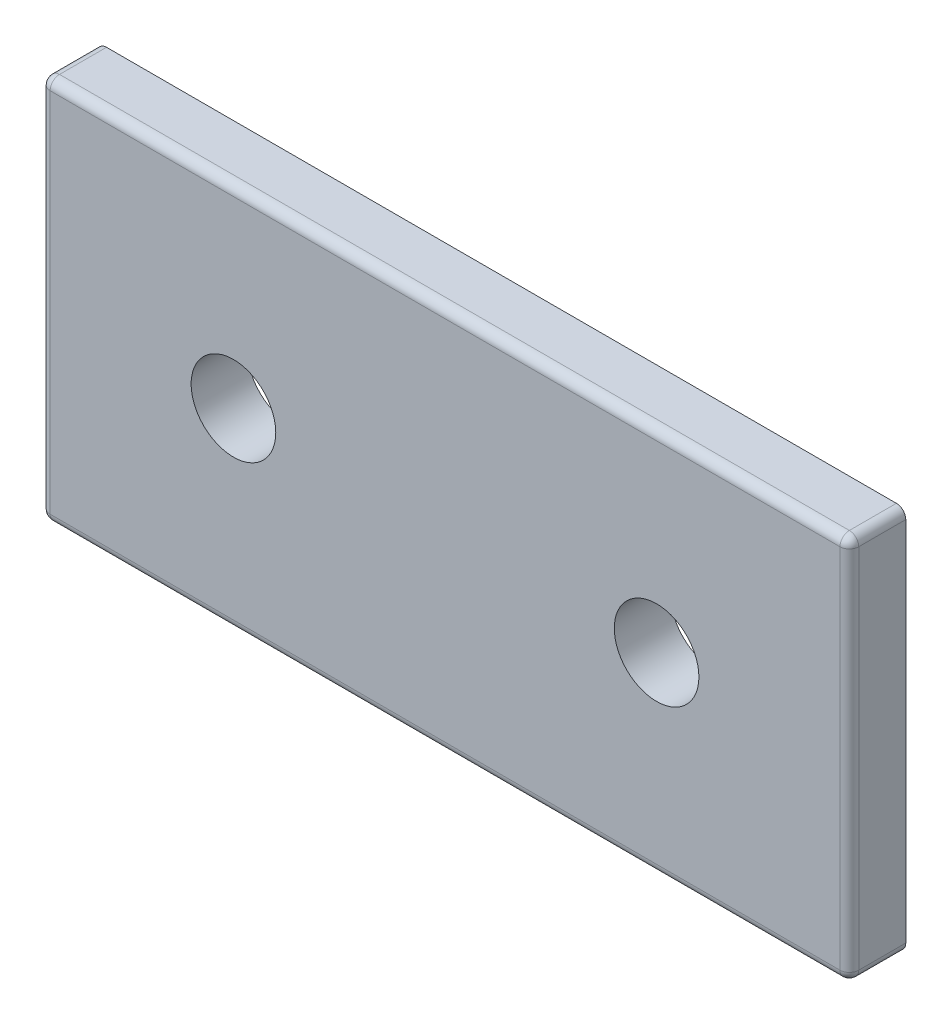
ISO-10303-21;
HEADER;
FILE_DESCRIPTION(('STEP AP214'),'2;1');
FILE_NAME('part.step','',(''),(''),'','','');
FILE_SCHEMA(('AUTOMOTIVE_DESIGN { 1 0 10303 214 1 1 1 1 }'));
ENDSEC;
DATA;
#1=APPLICATION_CONTEXT('core data for automotive mechanical design processes');
#2=APPLICATION_PROTOCOL_DEFINITION('international standard','automotive_design',2000,#1);
#3=PRODUCT_CONTEXT('',#1,'mechanical');
#4=PRODUCT('Part','Part','',(#3));
#5=PRODUCT_RELATED_PRODUCT_CATEGORY('part','',(#4));
#6=PRODUCT_DEFINITION_FORMATION('','',#4);
#7=PRODUCT_DEFINITION_CONTEXT('part definition',#1,'design');
#8=PRODUCT_DEFINITION('design','',#6,#7);
#9=PRODUCT_DEFINITION_SHAPE('','',#8);
#10=(LENGTH_UNIT() NAMED_UNIT(*) SI_UNIT(.MILLI.,.METRE.));
#11=(NAMED_UNIT(*) PLANE_ANGLE_UNIT() SI_UNIT($,.RADIAN.));
#12=(NAMED_UNIT(*) SI_UNIT($,.STERADIAN.) SOLID_ANGLE_UNIT());
#13=UNCERTAINTY_MEASURE_WITH_UNIT(LENGTH_MEASURE(1.E-05),#10,'distance_accuracy_value','');
#14=(GEOMETRIC_REPRESENTATION_CONTEXT(3) GLOBAL_UNCERTAINTY_ASSIGNED_CONTEXT((#13)) GLOBAL_UNIT_ASSIGNED_CONTEXT((#10,
#11,#12)) REPRESENTATION_CONTEXT('',''));
#15=CARTESIAN_POINT('',(0.,0.,0.));
#16=DIRECTION('',(0.,0.,1.));
#17=DIRECTION('',(1.,0.,0.));
#18=AXIS2_PLACEMENT_3D('',#15,#16,#17);
#19=CARTESIAN_POINT('',(0.,0.,3.));
#20=DIRECTION('',(0.,0.,-1.));
#21=DIRECTION('',(-1.,0.,0.));
#22=AXIS2_PLACEMENT_3D('',#19,#20,#21);
#23=PLANE('',#22);
#24=DIRECTION('',(-1.,0.,0.));
#25=VECTOR('',#24,1.);
#26=CARTESIAN_POINT('',(0.,40.,3.));
#27=LINE('',#26,#25);
#28=CARTESIAN_POINT('',(85.,40.,3.));
#29=VERTEX_POINT('',#28);
#30=CARTESIAN_POINT('',(1.,40.,3.));
#31=VERTEX_POINT('',#30);
#32=EDGE_CURVE('E309',#29,#31,#27,.T.);
#33=ORIENTED_EDGE('',*,*,#32,.T.);
#34=DIRECTION('',(0.,-1.,0.));
#35=VECTOR('',#34,1.);
#36=CARTESIAN_POINT('',(1.,0.,3.));
#37=LINE('',#36,#35);
#38=CARTESIAN_POINT('',(1.,1.,3.));
#39=VERTEX_POINT('',#38);
#40=EDGE_CURVE('E318',#31,#39,#37,.T.);
#41=ORIENTED_EDGE('',*,*,#40,.T.);
#42=DIRECTION('',(1.,0.,0.));
#43=VECTOR('',#42,1.);
#44=CARTESIAN_POINT('',(0.,1.,3.));
#45=LINE('',#44,#43);
#46=CARTESIAN_POINT('',(85.,1.00000000000001,3.));
#47=VERTEX_POINT('',#46);
#48=EDGE_CURVE('E315',#39,#47,#45,.T.);
#49=ORIENTED_EDGE('',*,*,#48,.T.);
#50=DIRECTION('',(0.,1.,0.));
#51=VECTOR('',#50,1.);
#52=CARTESIAN_POINT('',(85.,0.,3.));
#53=LINE('',#52,#51);
#54=EDGE_CURVE('E312',#47,#29,#53,.T.);
#55=ORIENTED_EDGE('',*,*,#54,.T.);
#56=EDGE_LOOP('',(#33,#41,#49,#55));
#57=FACE_BOUND('',#56,.T.);
#58=CARTESIAN_POINT('',(20.5,20.5,3.));
#59=DIRECTION('',(0.,0.,1.));
#60=DIRECTION('',(1.,0.,0.));
#61=AXIS2_PLACEMENT_3D('',#58,#59,#60);
#62=CIRCLE('',#61,4.5);
#63=CARTESIAN_POINT('',(25.,20.5,3.));
#64=VERTEX_POINT('',#63);
#65=EDGE_CURVE('E273',#64,#64,#62,.T.);
#66=ORIENTED_EDGE('',*,*,#65,.F.);
#67=EDGE_LOOP('',(#66));
#68=FACE_BOUND('',#67,.T.);
#69=CARTESIAN_POINT('',(65.5,20.5,3.));
#70=DIRECTION('',(0.,0.,1.));
#71=DIRECTION('',(1.,0.,0.));
#72=AXIS2_PLACEMENT_3D('',#69,#70,#71);
#73=CIRCLE('',#72,4.5);
#74=CARTESIAN_POINT('',(70.,20.5,3.));
#75=VERTEX_POINT('',#74);
#76=EDGE_CURVE('E386',#75,#75,#73,.T.);
#77=ORIENTED_EDGE('',*,*,#76,.F.);
#78=EDGE_LOOP('',(#77));
#79=FACE_BOUND('',#78,.T.);
#80=ADVANCED_FACE('F165',(#57,#68,#79),#23,.F.);
#81=CARTESIAN_POINT('',(0.,0.,-3.));
#82=DIRECTION('',(0.,0.,-1.));
#83=DIRECTION('',(-1.,0.,0.));
#84=AXIS2_PLACEMENT_3D('',#81,#82,#83);
#85=PLANE('',#84);
#86=CARTESIAN_POINT('',(20.5,20.5,-3.));
#87=DIRECTION('',(0.,0.,1.));
#88=DIRECTION('',(1.,0.,0.));
#89=AXIS2_PLACEMENT_3D('',#86,#87,#88);
#90=CIRCLE('',#89,4.5);
#91=CARTESIAN_POINT('',(25.,20.5,-3.));
#92=VERTEX_POINT('',#91);
#93=EDGE_CURVE('E281',#92,#92,#90,.T.);
#94=ORIENTED_EDGE('',*,*,#93,.T.);
#95=EDGE_LOOP('',(#94));
#96=FACE_BOUND('',#95,.T.);
#97=DIRECTION('',(1.,0.,0.));
#98=VECTOR('',#97,1.);
#99=CARTESIAN_POINT('',(86.,0.,-3.));
#100=LINE('',#99,#98);
#101=CARTESIAN_POINT('',(1.,0.,-3.));
#102=VERTEX_POINT('',#101);
#103=CARTESIAN_POINT('',(85.,0.,-3.));
#104=VERTEX_POINT('',#103);
#105=EDGE_CURVE('E259',#102,#104,#100,.T.);
#106=ORIENTED_EDGE('',*,*,#105,.F.);
#107=CARTESIAN_POINT('',(1.,1.,-3.));
#108=DIRECTION('',(0.,0.,-1.));
#109=DIRECTION('',(-1.,0.,0.));
#110=AXIS2_PLACEMENT_3D('',#107,#108,#109);
#111=CIRCLE('',#110,1.);
#112=CARTESIAN_POINT('',(0.,1.,-3.));
#113=VERTEX_POINT('',#112);
#114=EDGE_CURVE('E242',#102,#113,#111,.T.);
#115=ORIENTED_EDGE('',*,*,#114,.T.);
#116=DIRECTION('',(0.,-1.,0.));
#117=VECTOR('',#116,1.);
#118=CARTESIAN_POINT('',(0.,0.,-3.));
#119=LINE('',#118,#117);
#120=CARTESIAN_POINT('',(0.,40.,-3.));
#121=VERTEX_POINT('',#120);
#122=EDGE_CURVE('E287',#121,#113,#119,.T.);
#123=ORIENTED_EDGE('',*,*,#122,.F.);
#124=CARTESIAN_POINT('',(1.,40.,-3.));
#125=DIRECTION('',(0.,0.,-1.));
#126=DIRECTION('',(-1.,0.,0.));
#127=AXIS2_PLACEMENT_3D('',#124,#125,#126);
#128=CIRCLE('',#127,1.);
#129=CARTESIAN_POINT('',(1.,41.,-3.));
#130=VERTEX_POINT('',#129);
#131=EDGE_CURVE('E265',#121,#130,#128,.T.);
#132=ORIENTED_EDGE('',*,*,#131,.T.);
#133=DIRECTION('',(-1.,0.,0.));
#134=VECTOR('',#133,1.);
#135=CARTESIAN_POINT('',(86.,41.,-3.));
#136=LINE('',#135,#134);
#137=CARTESIAN_POINT('',(85.,41.,-3.));
#138=VERTEX_POINT('',#137);
#139=EDGE_CURVE('E278',#138,#130,#136,.T.);
#140=ORIENTED_EDGE('',*,*,#139,.F.);
#141=CARTESIAN_POINT('',(85.,40.,-3.));
#142=DIRECTION('',(0.,0.,-1.));
#143=DIRECTION('',(-1.,0.,0.));
#144=AXIS2_PLACEMENT_3D('',#141,#142,#143);
#145=CIRCLE('',#144,1.);
#146=CARTESIAN_POINT('',(86.,40.,-3.));
#147=VERTEX_POINT('',#146);
#148=EDGE_CURVE('E297',#138,#147,#145,.T.);
#149=ORIENTED_EDGE('',*,*,#148,.T.);
#150=DIRECTION('',(0.,1.,0.));
#151=VECTOR('',#150,1.);
#152=CARTESIAN_POINT('',(86.,41.,-3.));
#153=LINE('',#152,#151);
#154=CARTESIAN_POINT('',(86.,1.00000000000001,-3.));
#155=VERTEX_POINT('',#154);
#156=EDGE_CURVE('E272',#155,#147,#153,.T.);
#157=ORIENTED_EDGE('',*,*,#156,.F.);
#158=CARTESIAN_POINT('',(85.,1.00000000000001,-3.));
#159=DIRECTION('',(0.,0.,-1.));
#160=DIRECTION('',(-1.,0.,0.));
#161=AXIS2_PLACEMENT_3D('',#158,#159,#160);
#162=CIRCLE('',#161,1.);
#163=EDGE_CURVE('E254',#155,#104,#162,.T.);
#164=ORIENTED_EDGE('',*,*,#163,.T.);
#165=EDGE_LOOP('',(#106,#115,#123,#132,#140,#149,#157,#164));
#166=FACE_BOUND('',#165,.T.);
#167=CARTESIAN_POINT('',(65.5,20.5,-3.));
#168=DIRECTION('',(0.,0.,1.));
#169=DIRECTION('',(1.,0.,0.));
#170=AXIS2_PLACEMENT_3D('',#167,#168,#169);
#171=CIRCLE('',#170,4.5);
#172=CARTESIAN_POINT('',(70.,20.5,-3.));
#173=VERTEX_POINT('',#172);
#174=EDGE_CURVE('E380',#173,#173,#171,.T.);
#175=ORIENTED_EDGE('',*,*,#174,.T.);
#176=EDGE_LOOP('',(#175));
#177=FACE_BOUND('',#176,.T.);
#178=ADVANCED_FACE('F267',(#96,#166,#177),#85,.T.);
#179=CARTESIAN_POINT('',(86.,0.,3.));
#180=DIRECTION('',(0.,1.,0.));
#181=DIRECTION('',(-1.,0.,0.));
#182=AXIS2_PLACEMENT_3D('',#179,#180,#181);
#183=PLANE('',#182);
#184=DIRECTION('',(1.,0.,0.));
#185=VECTOR('',#184,1.);
#186=CARTESIAN_POINT('',(86.,0.,2.));
#187=LINE('',#186,#185);
#188=CARTESIAN_POINT('',(85.,0.,2.));
#189=VERTEX_POINT('',#188);
#190=CARTESIAN_POINT('',(1.,0.,2.));
#191=VERTEX_POINT('',#190);
#192=EDGE_CURVE('E262',#189,#191,#187,.F.);
#193=ORIENTED_EDGE('',*,*,#192,.T.);
#194=DIRECTION('',(0.,0.,-1.));
#195=VECTOR('',#194,1.);
#196=CARTESIAN_POINT('',(1.,0.,3.));
#197=LINE('',#196,#195);
#198=EDGE_CURVE('E246',#191,#102,#197,.T.);
#199=ORIENTED_EDGE('',*,*,#198,.T.);
#200=ORIENTED_EDGE('',*,*,#105,.T.);
#201=DIRECTION('',(0.,0.,-1.));
#202=VECTOR('',#201,1.);
#203=CARTESIAN_POINT('',(85.,0.,3.));
#204=LINE('',#203,#202);
#205=EDGE_CURVE('E290',#104,#189,#204,.F.);
#206=ORIENTED_EDGE('',*,*,#205,.T.);
#207=EDGE_LOOP('',(#193,#199,#200,#206));
#208=FACE_BOUND('',#207,.T.);
#209=ADVANCED_FACE('F258',(#208),#183,.F.);
#210=CARTESIAN_POINT('',(86.,41.,3.));
#211=DIRECTION('',(-1.,0.,0.));
#212=DIRECTION('',(0.,0.,1.));
#213=AXIS2_PLACEMENT_3D('',#210,#211,#212);
#214=PLANE('',#213);
#215=DIRECTION('',(0.,1.,0.));
#216=VECTOR('',#215,1.);
#217=CARTESIAN_POINT('',(86.,41.,2.));
#218=LINE('',#217,#216);
#219=CARTESIAN_POINT('',(86.,40.,2.));
#220=VERTEX_POINT('',#219);
#221=CARTESIAN_POINT('',(86.,1.00000000000001,2.));
#222=VERTEX_POINT('',#221);
#223=EDGE_CURVE('E325',#220,#222,#218,.F.);
#224=ORIENTED_EDGE('',*,*,#223,.T.);
#225=DIRECTION('',(0.,0.,-1.));
#226=VECTOR('',#225,1.);
#227=CARTESIAN_POINT('',(86.,1.00000000000001,3.));
#228=LINE('',#227,#226);
#229=EDGE_CURVE('E328',#222,#155,#228,.T.);
#230=ORIENTED_EDGE('',*,*,#229,.T.);
#231=ORIENTED_EDGE('',*,*,#156,.T.);
#232=DIRECTION('',(0.,0.,-1.));
#233=VECTOR('',#232,1.);
#234=CARTESIAN_POINT('',(86.,40.,3.));
#235=LINE('',#234,#233);
#236=EDGE_CURVE('E322',#147,#220,#235,.F.);
#237=ORIENTED_EDGE('',*,*,#236,.T.);
#238=EDGE_LOOP('',(#224,#230,#231,#237));
#239=FACE_BOUND('',#238,.T.);
#240=ADVANCED_FACE('F424',(#239),#214,.F.);
#241=CARTESIAN_POINT('',(86.,41.,3.));
#242=DIRECTION('',(0.,-1.,0.));
#243=DIRECTION('',(1.,0.,0.));
#244=AXIS2_PLACEMENT_3D('',#241,#242,#243);
#245=PLANE('',#244);
#246=DIRECTION('',(-1.,0.,0.));
#247=VECTOR('',#246,1.);
#248=CARTESIAN_POINT('',(86.,41.,2.));
#249=LINE('',#248,#247);
#250=CARTESIAN_POINT('',(1.,41.,2.));
#251=VERTEX_POINT('',#250);
#252=CARTESIAN_POINT('',(85.,41.,2.));
#253=VERTEX_POINT('',#252);
#254=EDGE_CURVE('E175',#251,#253,#249,.F.);
#255=ORIENTED_EDGE('',*,*,#254,.T.);
#256=DIRECTION('',(0.,0.,-1.));
#257=VECTOR('',#256,1.);
#258=CARTESIAN_POINT('',(85.,41.,3.));
#259=LINE('',#258,#257);
#260=EDGE_CURVE('E12',#253,#138,#259,.T.);
#261=ORIENTED_EDGE('',*,*,#260,.T.);
#262=ORIENTED_EDGE('',*,*,#139,.T.);
#263=DIRECTION('',(0.,0.,-1.));
#264=VECTOR('',#263,1.);
#265=CARTESIAN_POINT('',(1.,41.,3.));
#266=LINE('',#265,#264);
#267=EDGE_CURVE('E186',#130,#251,#266,.F.);
#268=ORIENTED_EDGE('',*,*,#267,.T.);
#269=EDGE_LOOP('',(#255,#261,#262,#268));
#270=FACE_BOUND('',#269,.T.);
#271=ADVANCED_FACE('F410',(#270),#245,.F.);
#272=CARTESIAN_POINT('',(0.,0.,3.));
#273=DIRECTION('',(1.,0.,0.));
#274=DIRECTION('',(0.,0.,-1.));
#275=AXIS2_PLACEMENT_3D('',#272,#273,#274);
#276=PLANE('',#275);
#277=ORIENTED_EDGE('',*,*,#122,.T.);
#278=DIRECTION('',(0.,0.,-1.));
#279=VECTOR('',#278,1.);
#280=CARTESIAN_POINT('',(0.,1.,3.));
#281=LINE('',#280,#279);
#282=CARTESIAN_POINT('',(0.,1.,2.));
#283=VERTEX_POINT('',#282);
#284=EDGE_CURVE('E247',#113,#283,#281,.F.);
#285=ORIENTED_EDGE('',*,*,#284,.T.);
#286=DIRECTION('',(0.,-1.,0.));
#287=VECTOR('',#286,1.);
#288=CARTESIAN_POINT('',(0.,0.,2.));
#289=LINE('',#288,#287);
#290=CARTESIAN_POINT('',(0.,40.,2.));
#291=VERTEX_POINT('',#290);
#292=EDGE_CURVE('E304',#283,#291,#289,.F.);
#293=ORIENTED_EDGE('',*,*,#292,.T.);
#294=DIRECTION('',(0.,0.,-1.));
#295=VECTOR('',#294,1.);
#296=CARTESIAN_POINT('',(0.,40.,3.));
#297=LINE('',#296,#295);
#298=EDGE_CURVE('E253',#291,#121,#297,.T.);
#299=ORIENTED_EDGE('',*,*,#298,.T.);
#300=EDGE_LOOP('',(#277,#285,#293,#299));
#301=FACE_BOUND('',#300,.T.);
#302=ADVANCED_FACE('F402',(#301),#276,.F.);
#303=CARTESIAN_POINT('',(20.5,20.5,3.));
#304=DIRECTION('',(0.,0.,-1.));
#305=DIRECTION('',(-1.,0.,0.));
#306=AXIS2_PLACEMENT_3D('',#303,#304,#305);
#307=CYLINDRICAL_SURFACE('',#306,4.5);
#308=ORIENTED_EDGE('',*,*,#65,.T.);
#309=EDGE_LOOP('',(#308));
#310=FACE_BOUND('',#309,.T.);
#311=ORIENTED_EDGE('',*,*,#93,.F.);
#312=EDGE_LOOP('',(#311));
#313=FACE_BOUND('',#312,.T.);
#314=ADVANCED_FACE('F399',(#310,#313),#307,.F.);
#315=CARTESIAN_POINT('',(65.5,20.5,3.));
#316=DIRECTION('',(0.,0.,-1.));
#317=DIRECTION('',(-1.,0.,0.));
#318=AXIS2_PLACEMENT_3D('',#315,#316,#317);
#319=CYLINDRICAL_SURFACE('',#318,4.5);
#320=ORIENTED_EDGE('',*,*,#76,.T.);
#321=EDGE_LOOP('',(#320));
#322=FACE_BOUND('',#321,.T.);
#323=ORIENTED_EDGE('',*,*,#174,.F.);
#324=EDGE_LOOP('',(#323));
#325=FACE_BOUND('',#324,.T.);
#326=ADVANCED_FACE('F401',(#322,#325),#319,.F.);
#327=CARTESIAN_POINT('',(85.,40.,3.));
#328=DIRECTION('',(0.,0.,-1.));
#329=DIRECTION('',(-1.,0.,0.));
#330=AXIS2_PLACEMENT_3D('',#327,#328,#329);
#331=CYLINDRICAL_SURFACE('',#330,1.);
#332=CARTESIAN_POINT('',(85.,40.,2.));
#333=DIRECTION('',(0.,0.,1.));
#334=DIRECTION('',(1.,0.,0.));
#335=AXIS2_PLACEMENT_3D('',#332,#333,#334);
#336=CIRCLE('',#335,1.);
#337=EDGE_CURVE('E169',#220,#253,#336,.T.);
#338=ORIENTED_EDGE('',*,*,#337,.F.);
#339=ORIENTED_EDGE('',*,*,#236,.F.);
#340=ORIENTED_EDGE('',*,*,#148,.F.);
#341=ORIENTED_EDGE('',*,*,#260,.F.);
#342=EDGE_LOOP('',(#338,#339,#340,#341));
#343=FACE_BOUND('',#342,.T.);
#344=ADVANCED_FACE('F167',(#343),#331,.T.);
#345=CARTESIAN_POINT('',(85.,40.,2.));
#346=DIRECTION('',(0.,0.,1.));
#347=DIRECTION('',(1.,0.,0.));
#348=AXIS2_PLACEMENT_3D('',#345,#346,#347);
#349=SPHERICAL_SURFACE('',#348,1.);
#350=CARTESIAN_POINT('',(85.,40.,2.));
#351=DIRECTION('',(0.,1.,0.));
#352=DIRECTION('',(0.,0.,1.));
#353=AXIS2_PLACEMENT_3D('',#350,#351,#352);
#354=CIRCLE('',#353,1.);
#355=EDGE_CURVE('E369',#220,#29,#354,.F.);
#356=ORIENTED_EDGE('',*,*,#355,.F.);
#357=ORIENTED_EDGE('',*,*,#337,.T.);
#358=CARTESIAN_POINT('',(85.,40.,2.));
#359=DIRECTION('',(1.,0.,0.));
#360=DIRECTION('',(0.,0.,-1.));
#361=AXIS2_PLACEMENT_3D('',#358,#359,#360);
#362=CIRCLE('',#361,1.);
#363=EDGE_CURVE('E372',#29,#253,#362,.F.);
#364=ORIENTED_EDGE('',*,*,#363,.F.);
#365=EDGE_LOOP('',(#356,#357,#364));
#366=FACE_BOUND('',#365,.T.);
#367=ADVANCED_FACE('F465',(#366),#349,.T.);
#368=CARTESIAN_POINT('',(1.,40.,3.));
#369=DIRECTION('',(0.,0.,-1.));
#370=DIRECTION('',(-1.,0.,0.));
#371=AXIS2_PLACEMENT_3D('',#368,#369,#370);
#372=CYLINDRICAL_SURFACE('',#371,1.);
#373=ORIENTED_EDGE('',*,*,#131,.F.);
#374=ORIENTED_EDGE('',*,*,#298,.F.);
#375=CARTESIAN_POINT('',(1.,40.,2.));
#376=DIRECTION('',(0.,0.,1.));
#377=DIRECTION('',(1.,0.,0.));
#378=AXIS2_PLACEMENT_3D('',#375,#376,#377);
#379=CIRCLE('',#378,1.);
#380=EDGE_CURVE('E365',#251,#291,#379,.T.);
#381=ORIENTED_EDGE('',*,*,#380,.F.);
#382=ORIENTED_EDGE('',*,*,#267,.F.);
#383=EDGE_LOOP('',(#373,#374,#381,#382));
#384=FACE_BOUND('',#383,.T.);
#385=ADVANCED_FACE('F463',(#384),#372,.T.);
#386=CARTESIAN_POINT('',(0.,40.,2.));
#387=DIRECTION('',(-1.,0.,0.));
#388=DIRECTION('',(0.,-1.,0.));
#389=AXIS2_PLACEMENT_3D('',#386,#387,#388);
#390=CYLINDRICAL_SURFACE('',#389,1.);
#391=ORIENTED_EDGE('',*,*,#363,.T.);
#392=ORIENTED_EDGE('',*,*,#254,.F.);
#393=CARTESIAN_POINT('',(1.,40.,2.));
#394=DIRECTION('',(-1.,0.,0.));
#395=DIRECTION('',(0.,0.,1.));
#396=AXIS2_PLACEMENT_3D('',#393,#394,#395);
#397=CIRCLE('',#396,1.);
#398=EDGE_CURVE('E361',#31,#251,#397,.T.);
#399=ORIENTED_EDGE('',*,*,#398,.F.);
#400=ORIENTED_EDGE('',*,*,#32,.F.);
#401=EDGE_LOOP('',(#391,#392,#399,#400));
#402=FACE_BOUND('',#401,.T.);
#403=ADVANCED_FACE('F459',(#402),#390,.T.);
#404=CARTESIAN_POINT('',(85.,0.,2.));
#405=DIRECTION('',(0.,1.,0.));
#406=DIRECTION('',(0.,0.,1.));
#407=AXIS2_PLACEMENT_3D('',#404,#405,#406);
#408=CYLINDRICAL_SURFACE('',#407,1.);
#409=ORIENTED_EDGE('',*,*,#355,.T.);
#410=ORIENTED_EDGE('',*,*,#54,.F.);
#411=CARTESIAN_POINT('',(85.,1.00000000000001,2.));
#412=DIRECTION('',(0.,-1.,0.));
#413=DIRECTION('',(0.,0.,-1.));
#414=AXIS2_PLACEMENT_3D('',#411,#412,#413);
#415=CIRCLE('',#414,1.);
#416=EDGE_CURVE('E357',#222,#47,#415,.T.);
#417=ORIENTED_EDGE('',*,*,#416,.F.);
#418=ORIENTED_EDGE('',*,*,#223,.F.);
#419=EDGE_LOOP('',(#409,#410,#417,#418));
#420=FACE_BOUND('',#419,.T.);
#421=ADVANCED_FACE('F455',(#420),#408,.T.);
#422=CARTESIAN_POINT('',(85.,1.00000000000001,3.));
#423=DIRECTION('',(0.,0.,-1.));
#424=DIRECTION('',(-1.,0.,0.));
#425=AXIS2_PLACEMENT_3D('',#422,#423,#424);
#426=CYLINDRICAL_SURFACE('',#425,1.);
#427=ORIENTED_EDGE('',*,*,#163,.F.);
#428=ORIENTED_EDGE('',*,*,#229,.F.);
#429=CARTESIAN_POINT('',(85.,1.00000000000001,2.));
#430=DIRECTION('',(0.,0.,1.));
#431=DIRECTION('',(1.,0.,0.));
#432=AXIS2_PLACEMENT_3D('',#429,#430,#431);
#433=CIRCLE('',#432,1.);
#434=EDGE_CURVE('E353',#189,#222,#433,.T.);
#435=ORIENTED_EDGE('',*,*,#434,.F.);
#436=ORIENTED_EDGE('',*,*,#205,.F.);
#437=EDGE_LOOP('',(#427,#428,#435,#436));
#438=FACE_BOUND('',#437,.T.);
#439=ADVANCED_FACE('F451',(#438),#426,.T.);
#440=CARTESIAN_POINT('',(1.,40.,2.));
#441=DIRECTION('',(0.,0.,1.));
#442=DIRECTION('',(1.,0.,0.));
#443=AXIS2_PLACEMENT_3D('',#440,#441,#442);
#444=SPHERICAL_SURFACE('',#443,1.);
#445=ORIENTED_EDGE('',*,*,#398,.T.);
#446=ORIENTED_EDGE('',*,*,#380,.T.);
#447=CARTESIAN_POINT('',(1.,40.,2.));
#448=DIRECTION('',(0.,1.,0.));
#449=DIRECTION('',(0.,0.,1.));
#450=AXIS2_PLACEMENT_3D('',#447,#448,#449);
#451=CIRCLE('',#450,1.);
#452=EDGE_CURVE('E349',#31,#291,#451,.F.);
#453=ORIENTED_EDGE('',*,*,#452,.F.);
#454=EDGE_LOOP('',(#445,#446,#453));
#455=FACE_BOUND('',#454,.T.);
#456=ADVANCED_FACE('F447',(#455),#444,.T.);
#457=CARTESIAN_POINT('',(85.,1.00000000000001,2.));
#458=DIRECTION('',(0.,0.,1.));
#459=DIRECTION('',(1.,0.,0.));
#460=AXIS2_PLACEMENT_3D('',#457,#458,#459);
#461=SPHERICAL_SURFACE('',#460,1.);
#462=ORIENTED_EDGE('',*,*,#434,.T.);
#463=ORIENTED_EDGE('',*,*,#416,.T.);
#464=CARTESIAN_POINT('',(85.,1.00000000000001,2.));
#465=DIRECTION('',(1.,0.,0.));
#466=DIRECTION('',(0.,0.,-1.));
#467=AXIS2_PLACEMENT_3D('',#464,#465,#466);
#468=CIRCLE('',#467,1.);
#469=EDGE_CURVE('E345',#189,#47,#468,.F.);
#470=ORIENTED_EDGE('',*,*,#469,.F.);
#471=EDGE_LOOP('',(#462,#463,#470));
#472=FACE_BOUND('',#471,.T.);
#473=ADVANCED_FACE('F443',(#472),#461,.T.);
#474=CARTESIAN_POINT('',(1.,0.,2.));
#475=DIRECTION('',(0.,-1.,0.));
#476=DIRECTION('',(0.,0.,-1.));
#477=AXIS2_PLACEMENT_3D('',#474,#475,#476);
#478=CYLINDRICAL_SURFACE('',#477,1.);
#479=ORIENTED_EDGE('',*,*,#452,.T.);
#480=ORIENTED_EDGE('',*,*,#292,.F.);
#481=CARTESIAN_POINT('',(1.,1.,2.));
#482=DIRECTION('',(0.,-1.,0.));
#483=DIRECTION('',(0.,0.,-1.));
#484=AXIS2_PLACEMENT_3D('',#481,#482,#483);
#485=CIRCLE('',#484,1.);
#486=EDGE_CURVE('E341',#39,#283,#485,.T.);
#487=ORIENTED_EDGE('',*,*,#486,.F.);
#488=ORIENTED_EDGE('',*,*,#40,.F.);
#489=EDGE_LOOP('',(#479,#480,#487,#488));
#490=FACE_BOUND('',#489,.T.);
#491=ADVANCED_FACE('F439',(#490),#478,.T.);
#492=CARTESIAN_POINT('',(0.,1.,2.));
#493=DIRECTION('',(1.,0.,0.));
#494=DIRECTION('',(0.,1.,0.));
#495=AXIS2_PLACEMENT_3D('',#492,#493,#494);
#496=CYLINDRICAL_SURFACE('',#495,1.);
#497=ORIENTED_EDGE('',*,*,#469,.T.);
#498=ORIENTED_EDGE('',*,*,#48,.F.);
#499=CARTESIAN_POINT('',(1.,1.,2.));
#500=DIRECTION('',(-1.,0.,0.));
#501=DIRECTION('',(0.,0.,1.));
#502=AXIS2_PLACEMENT_3D('',#499,#500,#501);
#503=CIRCLE('',#502,1.);
#504=EDGE_CURVE('E338',#191,#39,#503,.T.);
#505=ORIENTED_EDGE('',*,*,#504,.F.);
#506=ORIENTED_EDGE('',*,*,#192,.F.);
#507=EDGE_LOOP('',(#497,#498,#505,#506));
#508=FACE_BOUND('',#507,.T.);
#509=ADVANCED_FACE('F435',(#508),#496,.T.);
#510=CARTESIAN_POINT('',(1.,1.,2.));
#511=DIRECTION('',(0.,0.,1.));
#512=DIRECTION('',(1.,0.,0.));
#513=AXIS2_PLACEMENT_3D('',#510,#511,#512);
#514=SPHERICAL_SURFACE('',#513,1.);
#515=ORIENTED_EDGE('',*,*,#504,.T.);
#516=ORIENTED_EDGE('',*,*,#486,.T.);
#517=CARTESIAN_POINT('',(1.,1.,2.));
#518=DIRECTION('',(0.,0.,1.));
#519=DIRECTION('',(1.,0.,0.));
#520=AXIS2_PLACEMENT_3D('',#517,#518,#519);
#521=CIRCLE('',#520,1.);
#522=EDGE_CURVE('E335',#191,#283,#521,.F.);
#523=ORIENTED_EDGE('',*,*,#522,.F.);
#524=EDGE_LOOP('',(#515,#516,#523));
#525=FACE_BOUND('',#524,.T.);
#526=ADVANCED_FACE('F432',(#525),#514,.T.);
#527=CARTESIAN_POINT('',(1.,1.,3.));
#528=DIRECTION('',(0.,0.,-1.));
#529=DIRECTION('',(-1.,0.,0.));
#530=AXIS2_PLACEMENT_3D('',#527,#528,#529);
#531=CYLINDRICAL_SURFACE('',#530,1.);
#532=ORIENTED_EDGE('',*,*,#522,.T.);
#533=ORIENTED_EDGE('',*,*,#284,.F.);
#534=ORIENTED_EDGE('',*,*,#114,.F.);
#535=ORIENTED_EDGE('',*,*,#198,.F.);
#536=EDGE_LOOP('',(#532,#533,#534,#535));
#537=FACE_BOUND('',#536,.T.);
#538=ADVANCED_FACE('F245',(#537),#531,.T.);
#539=CLOSED_SHELL('',(#80,#178,#209,#240,#271,#302,#314,#326,#344,#367,#385,#403,#421,#439,#456,
#473,#491,#509,#526,#538));
#540=MANIFOLD_SOLID_BREP('B2',#539);
#541=ADVANCED_BREP_SHAPE_REPRESENTATION('',(#18,#540),#14);
#542=SHAPE_DEFINITION_REPRESENTATION(#9,#541);
ENDSEC;
END-ISO-10303-21;
